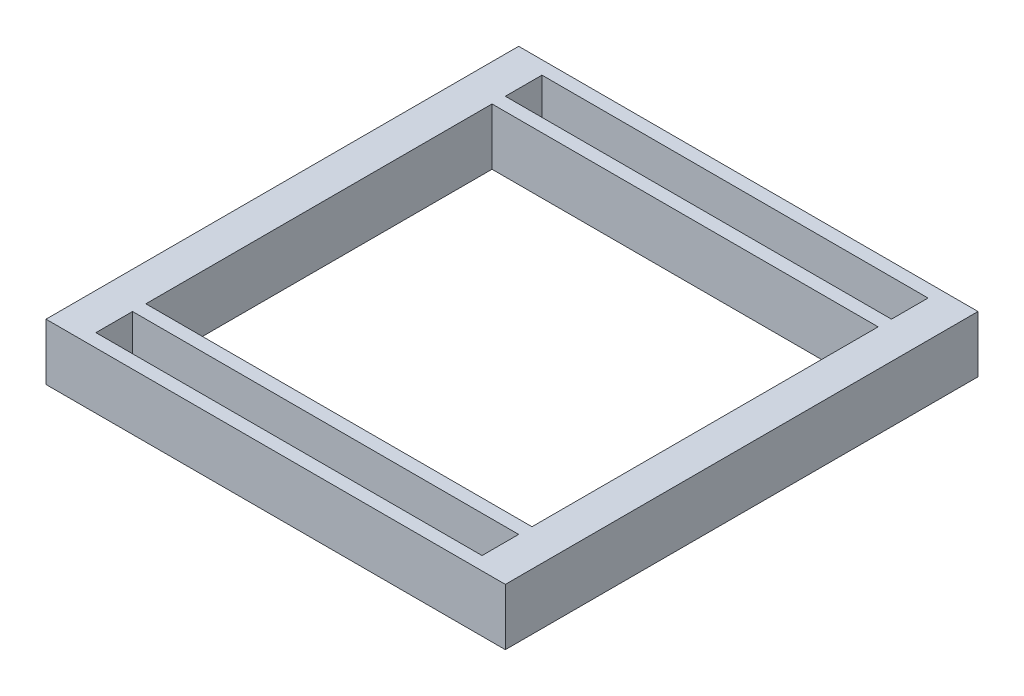
ISO-10303-21;
HEADER;
FILE_DESCRIPTION(('STEP AP214'),'2;1');
FILE_NAME('part.step','',(''),(''),'','','');
FILE_SCHEMA(('AUTOMOTIVE_DESIGN { 1 0 10303 214 1 1 1 1 }'));
ENDSEC;
DATA;
#1=APPLICATION_CONTEXT('core data for automotive mechanical design processes');
#2=APPLICATION_PROTOCOL_DEFINITION('international standard','automotive_design',2000,#1);
#3=PRODUCT_CONTEXT('',#1,'mechanical');
#4=PRODUCT('Part','Part','',(#3));
#5=PRODUCT_RELATED_PRODUCT_CATEGORY('part','',(#4));
#6=PRODUCT_DEFINITION_FORMATION('','',#4);
#7=PRODUCT_DEFINITION_CONTEXT('part definition',#1,'design');
#8=PRODUCT_DEFINITION('design','',#6,#7);
#9=PRODUCT_DEFINITION_SHAPE('','',#8);
#10=(LENGTH_UNIT() NAMED_UNIT(*) SI_UNIT(.MILLI.,.METRE.));
#11=(NAMED_UNIT(*) PLANE_ANGLE_UNIT() SI_UNIT($,.RADIAN.));
#12=(NAMED_UNIT(*) SI_UNIT($,.STERADIAN.) SOLID_ANGLE_UNIT());
#13=UNCERTAINTY_MEASURE_WITH_UNIT(LENGTH_MEASURE(1.E-05),#10,'distance_accuracy_value','');
#14=(GEOMETRIC_REPRESENTATION_CONTEXT(3) GLOBAL_UNCERTAINTY_ASSIGNED_CONTEXT((#13)) GLOBAL_UNIT_ASSIGNED_CONTEXT((#10,
#11,#12)) REPRESENTATION_CONTEXT('',''));
#15=CARTESIAN_POINT('',(0.,0.,0.));
#16=DIRECTION('',(0.,0.,1.));
#17=DIRECTION('',(1.,0.,0.));
#18=AXIS2_PLACEMENT_3D('',#15,#16,#17);
#19=CARTESIAN_POINT('',(0.,86.36,0.));
#20=DIRECTION('',(0.,-1.,0.));
#21=DIRECTION('',(0.,0.,-1.));
#22=AXIS2_PLACEMENT_3D('',#19,#20,#21);
#23=PLANE('',#22);
#24=DIRECTION('',(0.,0.,1.));
#25=VECTOR('',#24,1.);
#26=CARTESIAN_POINT('',(-294.64,86.36,-264.16));
#27=LINE('',#26,#25);
#28=CARTESIAN_POINT('',(-294.64,86.36,-264.16));
#29=VERTEX_POINT('',#28);
#30=CARTESIAN_POINT('',(-294.64,86.36,264.16));
#31=VERTEX_POINT('',#30);
#32=EDGE_CURVE('E201',#29,#31,#27,.T.);
#33=ORIENTED_EDGE('',*,*,#32,.F.);
#34=DIRECTION('',(-1.,0.,0.));
#35=VECTOR('',#34,1.);
#36=CARTESIAN_POINT('',(-294.64,86.36,-264.16));
#37=LINE('',#36,#35);
#38=CARTESIAN_POINT('',(294.64,86.36,-264.16));
#39=VERTEX_POINT('',#38);
#40=EDGE_CURVE('E212',#39,#29,#37,.T.);
#41=ORIENTED_EDGE('',*,*,#40,.F.);
#42=DIRECTION('',(0.,0.,-1.));
#43=VECTOR('',#42,1.);
#44=CARTESIAN_POINT('',(294.64,86.36,-264.16));
#45=LINE('',#44,#43);
#46=CARTESIAN_POINT('',(294.64,86.36,264.16));
#47=VERTEX_POINT('',#46);
#48=EDGE_CURVE('E208',#47,#39,#45,.T.);
#49=ORIENTED_EDGE('',*,*,#48,.F.);
#50=DIRECTION('',(1.,0.,0.));
#51=VECTOR('',#50,1.);
#52=CARTESIAN_POINT('',(-294.64,86.36,264.16));
#53=LINE('',#52,#51);
#54=EDGE_CURVE('E204',#31,#47,#53,.T.);
#55=ORIENTED_EDGE('',*,*,#54,.F.);
#56=EDGE_LOOP('',(#33,#41,#49,#55));
#57=FACE_BOUND('',#56,.T.);
#58=DIRECTION('',(0.,0.,-1.));
#59=VECTOR('',#58,1.);
#60=CARTESIAN_POINT('',(350.52,86.36,360.68));
#61=LINE('',#60,#59);
#62=CARTESIAN_POINT('',(350.52,86.36,360.68));
#63=VERTEX_POINT('',#62);
#64=CARTESIAN_POINT('',(350.52,86.36,-360.68));
#65=VERTEX_POINT('',#64);
#66=EDGE_CURVE('E287',#63,#65,#61,.T.);
#67=ORIENTED_EDGE('',*,*,#66,.T.);
#68=DIRECTION('',(-1.,0.,0.));
#69=VECTOR('',#68,1.);
#70=CARTESIAN_POINT('',(-350.52,86.36,-360.68));
#71=LINE('',#70,#69);
#72=CARTESIAN_POINT('',(-350.52,86.36,-360.68));
#73=VERTEX_POINT('',#72);
#74=EDGE_CURVE('E291',#65,#73,#71,.T.);
#75=ORIENTED_EDGE('',*,*,#74,.T.);
#76=DIRECTION('',(0.,0.,1.));
#77=VECTOR('',#76,1.);
#78=CARTESIAN_POINT('',(-350.52,86.36,360.68));
#79=LINE('',#78,#77);
#80=CARTESIAN_POINT('',(-350.52,86.36,360.68));
#81=VERTEX_POINT('',#80);
#82=EDGE_CURVE('E295',#73,#81,#79,.T.);
#83=ORIENTED_EDGE('',*,*,#82,.T.);
#84=DIRECTION('',(1.,0.,0.));
#85=VECTOR('',#84,1.);
#86=CARTESIAN_POINT('',(-350.52,86.36,360.68));
#87=LINE('',#86,#85);
#88=EDGE_CURVE('E298',#81,#63,#87,.T.);
#89=ORIENTED_EDGE('',*,*,#88,.T.);
#90=EDGE_LOOP('',(#67,#75,#83,#89));
#91=FACE_BOUND('',#90,.T.);
#92=DIRECTION('',(0.,0.,1.));
#93=VECTOR('',#92,1.);
#94=CARTESIAN_POINT('',(-294.64,86.36,-340.36));
#95=LINE('',#94,#93);
#96=CARTESIAN_POINT('',(-294.64,86.36,-340.36));
#97=VERTEX_POINT('',#96);
#98=CARTESIAN_POINT('',(-294.64,86.36,-284.48));
#99=VERTEX_POINT('',#98);
#100=EDGE_CURVE('E244',#97,#99,#95,.T.);
#101=ORIENTED_EDGE('',*,*,#100,.F.);
#102=DIRECTION('',(-1.,0.,0.));
#103=VECTOR('',#102,1.);
#104=CARTESIAN_POINT('',(-294.64,86.36,-340.36));
#105=LINE('',#104,#103);
#106=CARTESIAN_POINT('',(294.64,86.36,-340.36));
#107=VERTEX_POINT('',#106);
#108=EDGE_CURVE('E255',#107,#97,#105,.T.);
#109=ORIENTED_EDGE('',*,*,#108,.F.);
#110=DIRECTION('',(0.,0.,-1.));
#111=VECTOR('',#110,1.);
#112=CARTESIAN_POINT('',(294.64,86.36,-340.36));
#113=LINE('',#112,#111);
#114=CARTESIAN_POINT('',(294.64,86.36,-284.48));
#115=VERTEX_POINT('',#114);
#116=EDGE_CURVE('E251',#115,#107,#113,.T.);
#117=ORIENTED_EDGE('',*,*,#116,.F.);
#118=DIRECTION('',(1.,0.,0.));
#119=VECTOR('',#118,1.);
#120=CARTESIAN_POINT('',(-294.64,86.36,-284.48));
#121=LINE('',#120,#119);
#122=EDGE_CURVE('E247',#99,#115,#121,.T.);
#123=ORIENTED_EDGE('',*,*,#122,.F.);
#124=EDGE_LOOP('',(#101,#109,#117,#123));
#125=FACE_BOUND('',#124,.T.);
#126=DIRECTION('',(0.,0.,1.));
#127=VECTOR('',#126,1.);
#128=CARTESIAN_POINT('',(-294.64,86.36,284.48));
#129=LINE('',#128,#127);
#130=CARTESIAN_POINT('',(-294.64,86.36,284.48));
#131=VERTEX_POINT('',#130);
#132=CARTESIAN_POINT('',(-294.64,86.36,340.36));
#133=VERTEX_POINT('',#132);
#134=EDGE_CURVE('E153',#131,#133,#129,.T.);
#135=ORIENTED_EDGE('',*,*,#134,.F.);
#136=DIRECTION('',(-1.,0.,0.));
#137=VECTOR('',#136,1.);
#138=CARTESIAN_POINT('',(-294.64,86.36,284.48));
#139=LINE('',#138,#137);
#140=CARTESIAN_POINT('',(294.64,86.36,284.48));
#141=VERTEX_POINT('',#140);
#142=EDGE_CURVE('E179',#141,#131,#139,.T.);
#143=ORIENTED_EDGE('',*,*,#142,.F.);
#144=DIRECTION('',(0.,0.,-1.));
#145=VECTOR('',#144,1.);
#146=CARTESIAN_POINT('',(294.64,86.36,284.48));
#147=LINE('',#146,#145);
#148=CARTESIAN_POINT('',(294.64,86.36,340.36));
#149=VERTEX_POINT('',#148);
#150=EDGE_CURVE('E175',#149,#141,#147,.T.);
#151=ORIENTED_EDGE('',*,*,#150,.F.);
#152=DIRECTION('',(1.,0.,0.));
#153=VECTOR('',#152,1.);
#154=CARTESIAN_POINT('',(-294.64,86.36,340.36));
#155=LINE('',#154,#153);
#156=EDGE_CURVE('E162',#133,#149,#155,.T.);
#157=ORIENTED_EDGE('',*,*,#156,.F.);
#158=EDGE_LOOP('',(#135,#143,#151,#157));
#159=FACE_BOUND('',#158,.T.);
#160=ADVANCED_FACE('F39',(#57,#91,#125,#159),#23,.F.);
#161=CARTESIAN_POINT('',(0.,0.,0.));
#162=DIRECTION('',(0.,-1.,0.));
#163=DIRECTION('',(0.,0.,-1.));
#164=AXIS2_PLACEMENT_3D('',#161,#162,#163);
#165=PLANE('',#164);
#166=DIRECTION('',(0.,0.,-1.));
#167=VECTOR('',#166,1.);
#168=CARTESIAN_POINT('',(350.52,0.,360.68));
#169=LINE('',#168,#167);
#170=CARTESIAN_POINT('',(350.52,0.,360.68));
#171=VERTEX_POINT('',#170);
#172=CARTESIAN_POINT('',(350.52,0.,-360.68));
#173=VERTEX_POINT('',#172);
#174=EDGE_CURVE('E286',#171,#173,#169,.T.);
#175=ORIENTED_EDGE('',*,*,#174,.F.);
#176=DIRECTION('',(1.,0.,0.));
#177=VECTOR('',#176,1.);
#178=CARTESIAN_POINT('',(-350.52,0.,360.68));
#179=LINE('',#178,#177);
#180=CARTESIAN_POINT('',(-350.52,0.,360.68));
#181=VERTEX_POINT('',#180);
#182=EDGE_CURVE('E292',#181,#171,#179,.T.);
#183=ORIENTED_EDGE('',*,*,#182,.F.);
#184=DIRECTION('',(0.,0.,1.));
#185=VECTOR('',#184,1.);
#186=CARTESIAN_POINT('',(-350.52,0.,360.68));
#187=LINE('',#186,#185);
#188=CARTESIAN_POINT('',(-350.52,0.,-360.68));
#189=VERTEX_POINT('',#188);
#190=EDGE_CURVE('E308',#189,#181,#187,.T.);
#191=ORIENTED_EDGE('',*,*,#190,.F.);
#192=DIRECTION('',(-1.,0.,0.));
#193=VECTOR('',#192,1.);
#194=CARTESIAN_POINT('',(-350.52,0.,-360.68));
#195=LINE('',#194,#193);
#196=EDGE_CURVE('E305',#173,#189,#195,.T.);
#197=ORIENTED_EDGE('',*,*,#196,.F.);
#198=EDGE_LOOP('',(#175,#183,#191,#197));
#199=FACE_BOUND('',#198,.T.);
#200=DIRECTION('',(-1.,0.,0.));
#201=VECTOR('',#200,1.);
#202=CARTESIAN_POINT('',(-294.64,0.,-340.36));
#203=LINE('',#202,#201);
#204=CARTESIAN_POINT('',(294.64,0.,-340.36));
#205=VERTEX_POINT('',#204);
#206=CARTESIAN_POINT('',(-294.64,0.,-340.36));
#207=VERTEX_POINT('',#206);
#208=EDGE_CURVE('E248',#205,#207,#203,.T.);
#209=ORIENTED_EDGE('',*,*,#208,.T.);
#210=DIRECTION('',(0.,0.,1.));
#211=VECTOR('',#210,1.);
#212=CARTESIAN_POINT('',(-294.64,0.,-340.36));
#213=LINE('',#212,#211);
#214=CARTESIAN_POINT('',(-294.64,0.,-284.48));
#215=VERTEX_POINT('',#214);
#216=EDGE_CURVE('E243',#207,#215,#213,.T.);
#217=ORIENTED_EDGE('',*,*,#216,.T.);
#218=DIRECTION('',(1.,0.,0.));
#219=VECTOR('',#218,1.);
#220=CARTESIAN_POINT('',(-294.64,0.,-284.48));
#221=LINE('',#220,#219);
#222=CARTESIAN_POINT('',(294.64,0.,-284.48));
#223=VERTEX_POINT('',#222);
#224=EDGE_CURVE('E262',#215,#223,#221,.T.);
#225=ORIENTED_EDGE('',*,*,#224,.T.);
#226=DIRECTION('',(0.,0.,-1.));
#227=VECTOR('',#226,1.);
#228=CARTESIAN_POINT('',(294.64,0.,-340.36));
#229=LINE('',#228,#227);
#230=EDGE_CURVE('E266',#223,#205,#229,.T.);
#231=ORIENTED_EDGE('',*,*,#230,.T.);
#232=EDGE_LOOP('',(#209,#217,#225,#231));
#233=FACE_BOUND('',#232,.T.);
#234=DIRECTION('',(-1.,0.,0.));
#235=VECTOR('',#234,1.);
#236=CARTESIAN_POINT('',(-294.64,0.,-264.16));
#237=LINE('',#236,#235);
#238=CARTESIAN_POINT('',(294.64,0.,-264.16));
#239=VERTEX_POINT('',#238);
#240=CARTESIAN_POINT('',(-294.64,0.,-264.16));
#241=VERTEX_POINT('',#240);
#242=EDGE_CURVE('E205',#239,#241,#237,.T.);
#243=ORIENTED_EDGE('',*,*,#242,.T.);
#244=DIRECTION('',(0.,0.,1.));
#245=VECTOR('',#244,1.);
#246=CARTESIAN_POINT('',(-294.64,0.,-264.16));
#247=LINE('',#246,#245);
#248=CARTESIAN_POINT('',(-294.64,0.,264.16));
#249=VERTEX_POINT('',#248);
#250=EDGE_CURVE('E171',#241,#249,#247,.T.);
#251=ORIENTED_EDGE('',*,*,#250,.T.);
#252=DIRECTION('',(1.,0.,0.));
#253=VECTOR('',#252,1.);
#254=CARTESIAN_POINT('',(-294.64,0.,264.16));
#255=LINE('',#254,#253);
#256=CARTESIAN_POINT('',(294.64,0.,264.16));
#257=VERTEX_POINT('',#256);
#258=EDGE_CURVE('E219',#249,#257,#255,.T.);
#259=ORIENTED_EDGE('',*,*,#258,.T.);
#260=DIRECTION('',(0.,0.,-1.));
#261=VECTOR('',#260,1.);
#262=CARTESIAN_POINT('',(294.64,0.,-264.16));
#263=LINE('',#262,#261);
#264=EDGE_CURVE('E223',#257,#239,#263,.T.);
#265=ORIENTED_EDGE('',*,*,#264,.T.);
#266=EDGE_LOOP('',(#243,#251,#259,#265));
#267=FACE_BOUND('',#266,.T.);
#268=DIRECTION('',(-1.,0.,0.));
#269=VECTOR('',#268,1.);
#270=CARTESIAN_POINT('',(-294.64,0.,284.48));
#271=LINE('',#270,#269);
#272=CARTESIAN_POINT('',(294.64,0.,284.48));
#273=VERTEX_POINT('',#272);
#274=CARTESIAN_POINT('',(-294.64,0.,284.48));
#275=VERTEX_POINT('',#274);
#276=EDGE_CURVE('E163',#273,#275,#271,.T.);
#277=ORIENTED_EDGE('',*,*,#276,.T.);
#278=DIRECTION('',(0.,0.,1.));
#279=VECTOR('',#278,1.);
#280=CARTESIAN_POINT('',(-294.64,0.,284.48));
#281=LINE('',#280,#279);
#282=CARTESIAN_POINT('',(-294.64,0.,340.36));
#283=VERTEX_POINT('',#282);
#284=EDGE_CURVE('E63',#275,#283,#281,.T.);
#285=ORIENTED_EDGE('',*,*,#284,.T.);
#286=DIRECTION('',(1.,0.,0.));
#287=VECTOR('',#286,1.);
#288=CARTESIAN_POINT('',(-294.64,0.,340.36));
#289=LINE('',#288,#287);
#290=CARTESIAN_POINT('',(294.64,0.,340.36));
#291=VERTEX_POINT('',#290);
#292=EDGE_CURVE('E169',#283,#291,#289,.T.);
#293=ORIENTED_EDGE('',*,*,#292,.T.);
#294=DIRECTION('',(0.,0.,-1.));
#295=VECTOR('',#294,1.);
#296=CARTESIAN_POINT('',(294.64,0.,284.48));
#297=LINE('',#296,#295);
#298=EDGE_CURVE('E188',#291,#273,#297,.T.);
#299=ORIENTED_EDGE('',*,*,#298,.T.);
#300=EDGE_LOOP('',(#277,#285,#293,#299));
#301=FACE_BOUND('',#300,.T.);
#302=ADVANCED_FACE('F331',(#199,#233,#267,#301),#165,.T.);
#303=CARTESIAN_POINT('',(350.52,86.36,360.68));
#304=DIRECTION('',(-1.,0.,0.));
#305=DIRECTION('',(0.,0.,1.));
#306=AXIS2_PLACEMENT_3D('',#303,#304,#305);
#307=PLANE('',#306);
#308=ORIENTED_EDGE('',*,*,#174,.T.);
#309=DIRECTION('',(0.,-1.,0.));
#310=VECTOR('',#309,1.);
#311=CARTESIAN_POINT('',(350.52,86.36,-360.68));
#312=LINE('',#311,#310);
#313=EDGE_CURVE('E11',#65,#173,#312,.T.);
#314=ORIENTED_EDGE('',*,*,#313,.F.);
#315=ORIENTED_EDGE('',*,*,#66,.F.);
#316=DIRECTION('',(0.,-1.,0.));
#317=VECTOR('',#316,1.);
#318=CARTESIAN_POINT('',(350.52,86.36,360.68));
#319=LINE('',#318,#317);
#320=EDGE_CURVE('E301',#63,#171,#319,.T.);
#321=ORIENTED_EDGE('',*,*,#320,.T.);
#322=EDGE_LOOP('',(#308,#314,#315,#321));
#323=FACE_BOUND('',#322,.T.);
#324=ADVANCED_FACE('F41',(#323),#307,.F.);
#325=CARTESIAN_POINT('',(-350.52,86.36,-360.68));
#326=DIRECTION('',(0.,0.,1.));
#327=DIRECTION('',(1.,0.,0.));
#328=AXIS2_PLACEMENT_3D('',#325,#326,#327);
#329=PLANE('',#328);
#330=ORIENTED_EDGE('',*,*,#196,.T.);
#331=DIRECTION('',(0.,-1.,0.));
#332=VECTOR('',#331,1.);
#333=CARTESIAN_POINT('',(-350.52,86.36,-360.68));
#334=LINE('',#333,#332);
#335=EDGE_CURVE('E48',#73,#189,#334,.T.);
#336=ORIENTED_EDGE('',*,*,#335,.F.);
#337=ORIENTED_EDGE('',*,*,#74,.F.);
#338=ORIENTED_EDGE('',*,*,#313,.T.);
#339=EDGE_LOOP('',(#330,#336,#337,#338));
#340=FACE_BOUND('',#339,.T.);
#341=ADVANCED_FACE('F342',(#340),#329,.F.);
#342=CARTESIAN_POINT('',(-350.52,86.36,360.68));
#343=DIRECTION('',(1.,0.,0.));
#344=DIRECTION('',(0.,0.,-1.));
#345=AXIS2_PLACEMENT_3D('',#342,#343,#344);
#346=PLANE('',#345);
#347=ORIENTED_EDGE('',*,*,#190,.T.);
#348=DIRECTION('',(0.,-1.,0.));
#349=VECTOR('',#348,1.);
#350=CARTESIAN_POINT('',(-350.52,86.36,360.68));
#351=LINE('',#350,#349);
#352=EDGE_CURVE('E316',#81,#181,#351,.T.);
#353=ORIENTED_EDGE('',*,*,#352,.F.);
#354=ORIENTED_EDGE('',*,*,#82,.F.);
#355=ORIENTED_EDGE('',*,*,#335,.T.);
#356=EDGE_LOOP('',(#347,#353,#354,#355));
#357=FACE_BOUND('',#356,.T.);
#358=ADVANCED_FACE('F325',(#357),#346,.F.);
#359=CARTESIAN_POINT('',(-350.52,86.36,360.68));
#360=DIRECTION('',(0.,0.,-1.));
#361=DIRECTION('',(-1.,0.,0.));
#362=AXIS2_PLACEMENT_3D('',#359,#360,#361);
#363=PLANE('',#362);
#364=ORIENTED_EDGE('',*,*,#182,.T.);
#365=ORIENTED_EDGE('',*,*,#320,.F.);
#366=ORIENTED_EDGE('',*,*,#88,.F.);
#367=ORIENTED_EDGE('',*,*,#352,.T.);
#368=EDGE_LOOP('',(#364,#365,#366,#367));
#369=FACE_BOUND('',#368,.T.);
#370=ADVANCED_FACE('F335',(#369),#363,.F.);
#371=CARTESIAN_POINT('',(-294.64,86.36,-340.36));
#372=DIRECTION('',(1.,0.,0.));
#373=DIRECTION('',(0.,0.,-1.));
#374=AXIS2_PLACEMENT_3D('',#371,#372,#373);
#375=PLANE('',#374);
#376=ORIENTED_EDGE('',*,*,#216,.F.);
#377=DIRECTION('',(0.,-1.,0.));
#378=VECTOR('',#377,1.);
#379=CARTESIAN_POINT('',(-294.64,86.36,-340.36));
#380=LINE('',#379,#378);
#381=EDGE_CURVE('E258',#97,#207,#380,.T.);
#382=ORIENTED_EDGE('',*,*,#381,.F.);
#383=ORIENTED_EDGE('',*,*,#100,.T.);
#384=DIRECTION('',(0.,-1.,0.));
#385=VECTOR('',#384,1.);
#386=CARTESIAN_POINT('',(-294.64,86.36,-284.48));
#387=LINE('',#386,#385);
#388=EDGE_CURVE('E282',#99,#215,#387,.T.);
#389=ORIENTED_EDGE('',*,*,#388,.T.);
#390=EDGE_LOOP('',(#376,#382,#383,#389));
#391=FACE_BOUND('',#390,.T.);
#392=ADVANCED_FACE('F358',(#391),#375,.T.);
#393=CARTESIAN_POINT('',(-294.64,86.36,-284.48));
#394=DIRECTION('',(0.,0.,-1.));
#395=DIRECTION('',(-1.,0.,0.));
#396=AXIS2_PLACEMENT_3D('',#393,#394,#395);
#397=PLANE('',#396);
#398=ORIENTED_EDGE('',*,*,#224,.F.);
#399=ORIENTED_EDGE('',*,*,#388,.F.);
#400=ORIENTED_EDGE('',*,*,#122,.T.);
#401=DIRECTION('',(0.,-1.,0.));
#402=VECTOR('',#401,1.);
#403=CARTESIAN_POINT('',(294.64,86.36,-284.48));
#404=LINE('',#403,#402);
#405=EDGE_CURVE('E279',#115,#223,#404,.T.);
#406=ORIENTED_EDGE('',*,*,#405,.T.);
#407=EDGE_LOOP('',(#398,#399,#400,#406));
#408=FACE_BOUND('',#407,.T.);
#409=ADVANCED_FACE('F365',(#408),#397,.T.);
#410=CARTESIAN_POINT('',(294.64,86.36,-340.36));
#411=DIRECTION('',(-1.,0.,0.));
#412=DIRECTION('',(0.,0.,1.));
#413=AXIS2_PLACEMENT_3D('',#410,#411,#412);
#414=PLANE('',#413);
#415=ORIENTED_EDGE('',*,*,#230,.F.);
#416=ORIENTED_EDGE('',*,*,#405,.F.);
#417=ORIENTED_EDGE('',*,*,#116,.T.);
#418=DIRECTION('',(0.,-1.,0.));
#419=VECTOR('',#418,1.);
#420=CARTESIAN_POINT('',(294.64,86.36,-340.36));
#421=LINE('',#420,#419);
#422=EDGE_CURVE('E276',#107,#205,#421,.T.);
#423=ORIENTED_EDGE('',*,*,#422,.T.);
#424=EDGE_LOOP('',(#415,#416,#417,#423));
#425=FACE_BOUND('',#424,.T.);
#426=ADVANCED_FACE('F370',(#425),#414,.T.);
#427=CARTESIAN_POINT('',(-294.64,86.36,-340.36));
#428=DIRECTION('',(0.,0.,1.));
#429=DIRECTION('',(1.,0.,0.));
#430=AXIS2_PLACEMENT_3D('',#427,#428,#429);
#431=PLANE('',#430);
#432=ORIENTED_EDGE('',*,*,#208,.F.);
#433=ORIENTED_EDGE('',*,*,#422,.F.);
#434=ORIENTED_EDGE('',*,*,#108,.T.);
#435=ORIENTED_EDGE('',*,*,#381,.T.);
#436=EDGE_LOOP('',(#432,#433,#434,#435));
#437=FACE_BOUND('',#436,.T.);
#438=ADVANCED_FACE('F377',(#437),#431,.T.);
#439=CARTESIAN_POINT('',(-294.64,86.36,-264.16));
#440=DIRECTION('',(1.,0.,0.));
#441=DIRECTION('',(0.,0.,-1.));
#442=AXIS2_PLACEMENT_3D('',#439,#440,#441);
#443=PLANE('',#442);
#444=ORIENTED_EDGE('',*,*,#250,.F.);
#445=DIRECTION('',(0.,-1.,0.));
#446=VECTOR('',#445,1.);
#447=CARTESIAN_POINT('',(-294.64,86.36,-264.16));
#448=LINE('',#447,#446);
#449=EDGE_CURVE('E215',#29,#241,#448,.T.);
#450=ORIENTED_EDGE('',*,*,#449,.F.);
#451=ORIENTED_EDGE('',*,*,#32,.T.);
#452=DIRECTION('',(0.,-1.,0.));
#453=VECTOR('',#452,1.);
#454=CARTESIAN_POINT('',(-294.64,86.36,264.16));
#455=LINE('',#454,#453);
#456=EDGE_CURVE('E239',#31,#249,#455,.T.);
#457=ORIENTED_EDGE('',*,*,#456,.T.);
#458=EDGE_LOOP('',(#444,#450,#451,#457));
#459=FACE_BOUND('',#458,.T.);
#460=ADVANCED_FACE('F390',(#459),#443,.T.);
#461=CARTESIAN_POINT('',(-294.64,86.36,264.16));
#462=DIRECTION('',(0.,0.,-1.));
#463=DIRECTION('',(-1.,0.,0.));
#464=AXIS2_PLACEMENT_3D('',#461,#462,#463);
#465=PLANE('',#464);
#466=ORIENTED_EDGE('',*,*,#258,.F.);
#467=ORIENTED_EDGE('',*,*,#456,.F.);
#468=ORIENTED_EDGE('',*,*,#54,.T.);
#469=DIRECTION('',(0.,-1.,0.));
#470=VECTOR('',#469,1.);
#471=CARTESIAN_POINT('',(294.64,86.36,264.16));
#472=LINE('',#471,#470);
#473=EDGE_CURVE('E236',#47,#257,#472,.T.);
#474=ORIENTED_EDGE('',*,*,#473,.T.);
#475=EDGE_LOOP('',(#466,#467,#468,#474));
#476=FACE_BOUND('',#475,.T.);
#477=ADVANCED_FACE('F395',(#476),#465,.T.);
#478=CARTESIAN_POINT('',(294.64,86.36,-264.16));
#479=DIRECTION('',(-1.,0.,0.));
#480=DIRECTION('',(0.,0.,1.));
#481=AXIS2_PLACEMENT_3D('',#478,#479,#480);
#482=PLANE('',#481);
#483=ORIENTED_EDGE('',*,*,#264,.F.);
#484=ORIENTED_EDGE('',*,*,#473,.F.);
#485=ORIENTED_EDGE('',*,*,#48,.T.);
#486=DIRECTION('',(0.,-1.,0.));
#487=VECTOR('',#486,1.);
#488=CARTESIAN_POINT('',(294.64,86.36,-264.16));
#489=LINE('',#488,#487);
#490=EDGE_CURVE('E233',#39,#239,#489,.T.);
#491=ORIENTED_EDGE('',*,*,#490,.T.);
#492=EDGE_LOOP('',(#483,#484,#485,#491));
#493=FACE_BOUND('',#492,.T.);
#494=ADVANCED_FACE('F399',(#493),#482,.T.);
#495=CARTESIAN_POINT('',(-294.64,86.36,-264.16));
#496=DIRECTION('',(0.,0.,1.));
#497=DIRECTION('',(1.,0.,0.));
#498=AXIS2_PLACEMENT_3D('',#495,#496,#497);
#499=PLANE('',#498);
#500=ORIENTED_EDGE('',*,*,#242,.F.);
#501=ORIENTED_EDGE('',*,*,#490,.F.);
#502=ORIENTED_EDGE('',*,*,#40,.T.);
#503=ORIENTED_EDGE('',*,*,#449,.T.);
#504=EDGE_LOOP('',(#500,#501,#502,#503));
#505=FACE_BOUND('',#504,.T.);
#506=ADVANCED_FACE('F403',(#505),#499,.T.);
#507=CARTESIAN_POINT('',(-294.64,86.36,284.48));
#508=DIRECTION('',(1.,0.,0.));
#509=DIRECTION('',(0.,0.,-1.));
#510=AXIS2_PLACEMENT_3D('',#507,#508,#509);
#511=PLANE('',#510);
#512=ORIENTED_EDGE('',*,*,#284,.F.);
#513=DIRECTION('',(0.,-1.,0.));
#514=VECTOR('',#513,1.);
#515=CARTESIAN_POINT('',(-294.64,86.36,284.48));
#516=LINE('',#515,#514);
#517=EDGE_CURVE('E157',#131,#275,#516,.T.);
#518=ORIENTED_EDGE('',*,*,#517,.F.);
#519=ORIENTED_EDGE('',*,*,#134,.T.);
#520=DIRECTION('',(0.,-1.,0.));
#521=VECTOR('',#520,1.);
#522=CARTESIAN_POINT('',(-294.64,86.36,340.36));
#523=LINE('',#522,#521);
#524=EDGE_CURVE('E156',#133,#283,#523,.T.);
#525=ORIENTED_EDGE('',*,*,#524,.T.);
#526=EDGE_LOOP('',(#512,#518,#519,#525));
#527=FACE_BOUND('',#526,.T.);
#528=ADVANCED_FACE('F155',(#527),#511,.T.);
#529=CARTESIAN_POINT('',(-294.64,86.36,340.36));
#530=DIRECTION('',(0.,0.,-1.));
#531=DIRECTION('',(-1.,0.,0.));
#532=AXIS2_PLACEMENT_3D('',#529,#530,#531);
#533=PLANE('',#532);
#534=ORIENTED_EDGE('',*,*,#292,.F.);
#535=ORIENTED_EDGE('',*,*,#524,.F.);
#536=ORIENTED_EDGE('',*,*,#156,.T.);
#537=DIRECTION('',(0.,-1.,0.));
#538=VECTOR('',#537,1.);
#539=CARTESIAN_POINT('',(294.64,86.36,340.36));
#540=LINE('',#539,#538);
#541=EDGE_CURVE('E172',#149,#291,#540,.T.);
#542=ORIENTED_EDGE('',*,*,#541,.T.);
#543=EDGE_LOOP('',(#534,#535,#536,#542));
#544=FACE_BOUND('',#543,.T.);
#545=ADVANCED_FACE('F166',(#544),#533,.T.);
#546=CARTESIAN_POINT('',(294.64,86.36,284.48));
#547=DIRECTION('',(-1.,0.,0.));
#548=DIRECTION('',(0.,0.,1.));
#549=AXIS2_PLACEMENT_3D('',#546,#547,#548);
#550=PLANE('',#549);
#551=ORIENTED_EDGE('',*,*,#298,.F.);
#552=ORIENTED_EDGE('',*,*,#541,.F.);
#553=ORIENTED_EDGE('',*,*,#150,.T.);
#554=DIRECTION('',(0.,-1.,0.));
#555=VECTOR('',#554,1.);
#556=CARTESIAN_POINT('',(294.64,86.36,284.48));
#557=LINE('',#556,#555);
#558=EDGE_CURVE('E55',#141,#273,#557,.T.);
#559=ORIENTED_EDGE('',*,*,#558,.T.);
#560=EDGE_LOOP('',(#551,#552,#553,#559));
#561=FACE_BOUND('',#560,.T.);
#562=ADVANCED_FACE('F412',(#561),#550,.T.);
#563=CARTESIAN_POINT('',(-294.64,86.36,284.48));
#564=DIRECTION('',(0.,0.,1.));
#565=DIRECTION('',(1.,0.,0.));
#566=AXIS2_PLACEMENT_3D('',#563,#564,#565);
#567=PLANE('',#566);
#568=ORIENTED_EDGE('',*,*,#276,.F.);
#569=ORIENTED_EDGE('',*,*,#558,.F.);
#570=ORIENTED_EDGE('',*,*,#142,.T.);
#571=ORIENTED_EDGE('',*,*,#517,.T.);
#572=EDGE_LOOP('',(#568,#569,#570,#571));
#573=FACE_BOUND('',#572,.T.);
#574=ADVANCED_FACE('F415',(#573),#567,.T.);
#575=CLOSED_SHELL('',(#160,#302,#324,#341,#358,#370,#392,#409,#426,#438,#460,#477,#494,#506,
#528,#545,#562,#574));
#576=MANIFOLD_SOLID_BREP('B2',#575);
#577=ADVANCED_BREP_SHAPE_REPRESENTATION('',(#18,#576),#14);
#578=SHAPE_DEFINITION_REPRESENTATION(#9,#577);
ENDSEC;
END-ISO-10303-21;
